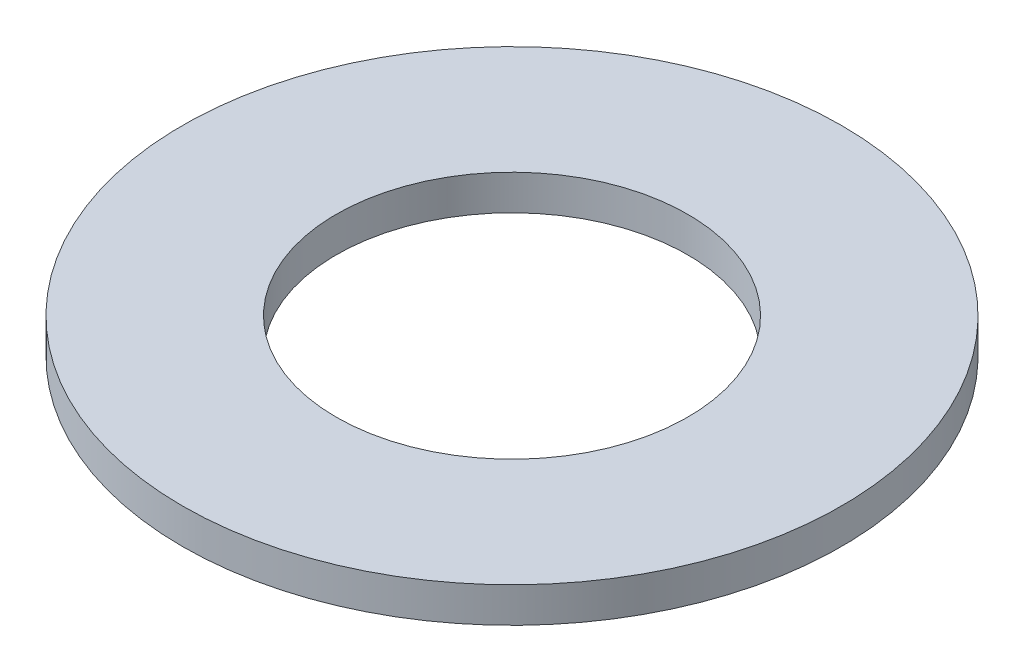
ISO-10303-21;
HEADER;
FILE_DESCRIPTION(('STEP AP214'),'2;1');
FILE_NAME('part.step','',(''),(''),'','','');
FILE_SCHEMA(('AUTOMOTIVE_DESIGN { 1 0 10303 214 1 1 1 1 }'));
ENDSEC;
DATA;
#1=APPLICATION_CONTEXT('core data for automotive mechanical design processes');
#2=APPLICATION_PROTOCOL_DEFINITION('international standard','automotive_design',2000,#1);
#3=PRODUCT_CONTEXT('',#1,'mechanical');
#4=PRODUCT('Part','Part','',(#3));
#5=PRODUCT_RELATED_PRODUCT_CATEGORY('part','',(#4));
#6=PRODUCT_DEFINITION_FORMATION('','',#4);
#7=PRODUCT_DEFINITION_CONTEXT('part definition',#1,'design');
#8=PRODUCT_DEFINITION('design','',#6,#7);
#9=PRODUCT_DEFINITION_SHAPE('','',#8);
#10=(LENGTH_UNIT() NAMED_UNIT(*) SI_UNIT(.MILLI.,.METRE.));
#11=(NAMED_UNIT(*) PLANE_ANGLE_UNIT() SI_UNIT($,.RADIAN.));
#12=(NAMED_UNIT(*) SI_UNIT($,.STERADIAN.) SOLID_ANGLE_UNIT());
#13=UNCERTAINTY_MEASURE_WITH_UNIT(LENGTH_MEASURE(1.E-05),#10,'distance_accuracy_value','');
#14=(GEOMETRIC_REPRESENTATION_CONTEXT(3) GLOBAL_UNCERTAINTY_ASSIGNED_CONTEXT((#13)) GLOBAL_UNIT_ASSIGNED_CONTEXT((#10,
#11,#12)) REPRESENTATION_CONTEXT('',''));
#15=CARTESIAN_POINT('',(0.,0.,0.));
#16=DIRECTION('',(0.,0.,1.));
#17=DIRECTION('',(1.,0.,0.));
#18=AXIS2_PLACEMENT_3D('',#15,#16,#17);
#19=CARTESIAN_POINT('',(0.,0.8,0.));
#20=DIRECTION('',(0.,1.,0.));
#21=DIRECTION('',(0.,0.,1.));
#22=AXIS2_PLACEMENT_3D('',#19,#20,#21);
#23=PLANE('',#22);
#24=CARTESIAN_POINT('',(0.,0.8,0.));
#25=DIRECTION('',(0.,1.,0.));
#26=DIRECTION('',(0.,0.,1.));
#27=AXIS2_PLACEMENT_3D('',#24,#25,#26);
#28=CIRCLE('',#27,7.5);
#29=CARTESIAN_POINT('',(0.,0.8,7.5));
#30=VERTEX_POINT('',#29);
#31=EDGE_CURVE('E10',#30,#30,#28,.T.);
#32=ORIENTED_EDGE('',*,*,#31,.T.);
#33=EDGE_LOOP('',(#32));
#34=FACE_BOUND('',#33,.T.);
#35=CARTESIAN_POINT('',(0.,0.8,0.));
#36=DIRECTION('',(0.,1.,0.));
#37=DIRECTION('',(0.,0.,1.));
#38=AXIS2_PLACEMENT_3D('',#35,#36,#37);
#39=CIRCLE('',#38,4.);
#40=CARTESIAN_POINT('',(0.,0.8,4.));
#41=VERTEX_POINT('',#40);
#42=EDGE_CURVE('E48',#41,#41,#39,.T.);
#43=ORIENTED_EDGE('',*,*,#42,.F.);
#44=EDGE_LOOP('',(#43));
#45=FACE_BOUND('',#44,.T.);
#46=ADVANCED_FACE('F37',(#34,#45),#23,.T.);
#47=CARTESIAN_POINT('',(0.,0.,0.));
#48=DIRECTION('',(0.,1.,0.));
#49=DIRECTION('',(0.,0.,1.));
#50=AXIS2_PLACEMENT_3D('',#47,#48,#49);
#51=PLANE('',#50);
#52=CARTESIAN_POINT('',(0.,0.,0.));
#53=DIRECTION('',(0.,1.,0.));
#54=DIRECTION('',(0.,0.,1.));
#55=AXIS2_PLACEMENT_3D('',#52,#53,#54);
#56=CIRCLE('',#55,7.5);
#57=CARTESIAN_POINT('',(0.,0.,7.5));
#58=VERTEX_POINT('',#57);
#59=EDGE_CURVE('E41',#58,#58,#56,.T.);
#60=ORIENTED_EDGE('',*,*,#59,.F.);
#61=EDGE_LOOP('',(#60));
#62=FACE_BOUND('',#61,.T.);
#63=CARTESIAN_POINT('',(0.,0.,0.));
#64=DIRECTION('',(0.,1.,0.));
#65=DIRECTION('',(0.,0.,1.));
#66=AXIS2_PLACEMENT_3D('',#63,#64,#65);
#67=CIRCLE('',#66,4.);
#68=CARTESIAN_POINT('',(0.,0.,4.));
#69=VERTEX_POINT('',#68);
#70=EDGE_CURVE('E50',#69,#69,#67,.T.);
#71=ORIENTED_EDGE('',*,*,#70,.T.);
#72=EDGE_LOOP('',(#71));
#73=FACE_BOUND('',#72,.T.);
#74=ADVANCED_FACE('F60',(#62,#73),#51,.F.);
#75=CARTESIAN_POINT('',(0.,0.8,0.));
#76=DIRECTION('',(0.,-1.,0.));
#77=DIRECTION('',(0.,0.,-1.));
#78=AXIS2_PLACEMENT_3D('',#75,#76,#77);
#79=CYLINDRICAL_SURFACE('',#78,7.5);
#80=ORIENTED_EDGE('',*,*,#31,.F.);
#81=EDGE_LOOP('',(#80));
#82=FACE_BOUND('',#81,.T.);
#83=ORIENTED_EDGE('',*,*,#59,.T.);
#84=EDGE_LOOP('',(#83));
#85=FACE_BOUND('',#84,.T.);
#86=ADVANCED_FACE('F39',(#82,#85),#79,.T.);
#87=CARTESIAN_POINT('',(0.,0.8,0.));
#88=DIRECTION('',(0.,-1.,0.));
#89=DIRECTION('',(0.,0.,-1.));
#90=AXIS2_PLACEMENT_3D('',#87,#88,#89);
#91=CYLINDRICAL_SURFACE('',#90,4.);
#92=ORIENTED_EDGE('',*,*,#42,.T.);
#93=EDGE_LOOP('',(#92));
#94=FACE_BOUND('',#93,.T.);
#95=ORIENTED_EDGE('',*,*,#70,.F.);
#96=EDGE_LOOP('',(#95));
#97=FACE_BOUND('',#96,.T.);
#98=ADVANCED_FACE('F56',(#94,#97),#91,.F.);
#99=CLOSED_SHELL('',(#46,#74,#86,#98));
#100=MANIFOLD_SOLID_BREP('B2',#99);
#101=ADVANCED_BREP_SHAPE_REPRESENTATION('',(#18,#100),#14);
#102=SHAPE_DEFINITION_REPRESENTATION(#9,#101);
ENDSEC;
END-ISO-10303-21;
